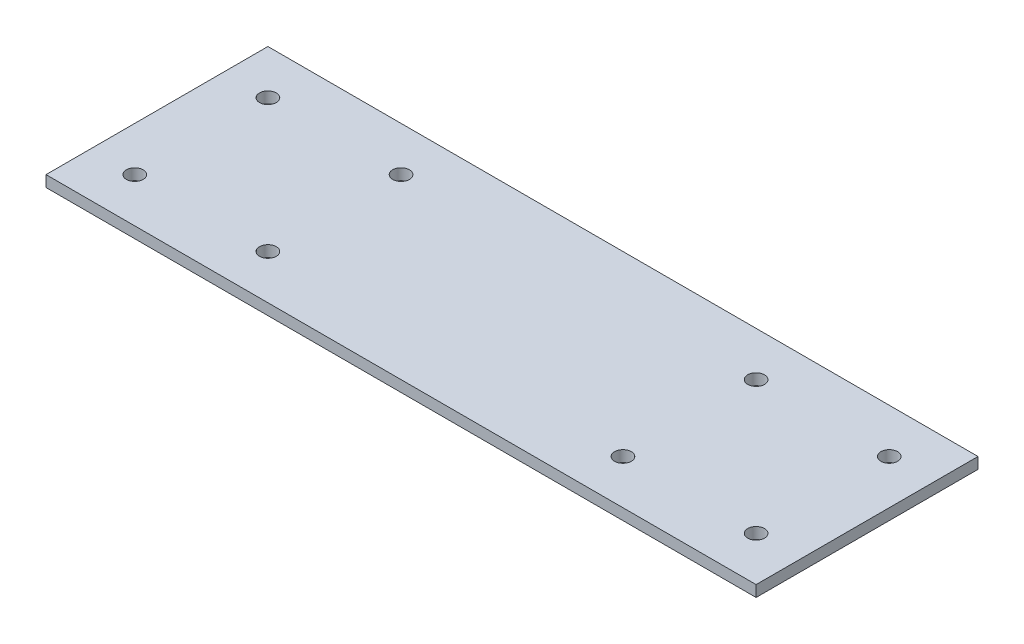
ISO-10303-21;
HEADER;
FILE_DESCRIPTION(('STEP AP214'),'2;1');
FILE_NAME('part.step','',(''),(''),'','','');
FILE_SCHEMA(('AUTOMOTIVE_DESIGN { 1 0 10303 214 1 1 1 1 }'));
ENDSEC;
DATA;
#1=APPLICATION_CONTEXT('core data for automotive mechanical design processes');
#2=APPLICATION_PROTOCOL_DEFINITION('international standard','automotive_design',2000,#1);
#3=PRODUCT_CONTEXT('',#1,'mechanical');
#4=PRODUCT('Part','Part','',(#3));
#5=PRODUCT_RELATED_PRODUCT_CATEGORY('part','',(#4));
#6=PRODUCT_DEFINITION_FORMATION('','',#4);
#7=PRODUCT_DEFINITION_CONTEXT('part definition',#1,'design');
#8=PRODUCT_DEFINITION('design','',#6,#7);
#9=PRODUCT_DEFINITION_SHAPE('','',#8);
#10=(LENGTH_UNIT() NAMED_UNIT(*) SI_UNIT(.MILLI.,.METRE.));
#11=(NAMED_UNIT(*) PLANE_ANGLE_UNIT() SI_UNIT($,.RADIAN.));
#12=(NAMED_UNIT(*) SI_UNIT($,.STERADIAN.) SOLID_ANGLE_UNIT());
#13=UNCERTAINTY_MEASURE_WITH_UNIT(LENGTH_MEASURE(1.E-05),#10,'distance_accuracy_value','');
#14=(GEOMETRIC_REPRESENTATION_CONTEXT(3) GLOBAL_UNCERTAINTY_ASSIGNED_CONTEXT((#13)) GLOBAL_UNIT_ASSIGNED_CONTEXT((#10,
#11,#12)) REPRESENTATION_CONTEXT('',''));
#15=CARTESIAN_POINT('',(0.,0.,0.));
#16=DIRECTION('',(0.,0.,1.));
#17=DIRECTION('',(1.,0.,0.));
#18=AXIS2_PLACEMENT_3D('',#15,#16,#17);
#19=CARTESIAN_POINT('',(50.8,1.6002,15.875));
#20=DIRECTION('',(-1.,0.,0.));
#21=DIRECTION('',(0.,0.,1.));
#22=AXIS2_PLACEMENT_3D('',#19,#20,#21);
#23=PLANE('',#22);
#24=DIRECTION('',(0.,0.,-1.));
#25=VECTOR('',#24,1.);
#26=CARTESIAN_POINT('',(50.8,0.,15.875));
#27=LINE('',#26,#25);
#28=CARTESIAN_POINT('',(50.8,0.,15.875));
#29=VERTEX_POINT('',#28);
#30=CARTESIAN_POINT('',(50.8,0.,-15.875));
#31=VERTEX_POINT('',#30);
#32=EDGE_CURVE('E107',#29,#31,#27,.T.);
#33=ORIENTED_EDGE('',*,*,#32,.T.);
#34=DIRECTION('',(0.,-1.,0.));
#35=VECTOR('',#34,1.);
#36=CARTESIAN_POINT('',(50.8,1.6002,-15.875));
#37=LINE('',#36,#35);
#38=CARTESIAN_POINT('',(50.8,1.6002,-15.875));
#39=VERTEX_POINT('',#38);
#40=EDGE_CURVE('E11',#39,#31,#37,.T.);
#41=ORIENTED_EDGE('',*,*,#40,.F.);
#42=DIRECTION('',(0.,0.,-1.));
#43=VECTOR('',#42,1.);
#44=CARTESIAN_POINT('',(50.8,1.6002,15.875));
#45=LINE('',#44,#43);
#46=CARTESIAN_POINT('',(50.8,1.6002,15.875));
#47=VERTEX_POINT('',#46);
#48=EDGE_CURVE('E91',#47,#39,#45,.T.);
#49=ORIENTED_EDGE('',*,*,#48,.F.);
#50=DIRECTION('',(0.,-1.,0.));
#51=VECTOR('',#50,1.);
#52=CARTESIAN_POINT('',(50.8,1.6002,15.875));
#53=LINE('',#52,#51);
#54=EDGE_CURVE('E103',#47,#29,#53,.T.);
#55=ORIENTED_EDGE('',*,*,#54,.T.);
#56=EDGE_LOOP('',(#33,#41,#49,#55));
#57=FACE_BOUND('',#56,.T.);
#58=ADVANCED_FACE('F39',(#57),#23,.F.);
#59=CARTESIAN_POINT('',(-50.8,1.6002,-15.875));
#60=DIRECTION('',(0.,0.,1.));
#61=DIRECTION('',(1.,0.,0.));
#62=AXIS2_PLACEMENT_3D('',#59,#60,#61);
#63=PLANE('',#62);
#64=DIRECTION('',(-1.,0.,0.));
#65=VECTOR('',#64,1.);
#66=CARTESIAN_POINT('',(-50.8,0.,-15.875));
#67=LINE('',#66,#65);
#68=CARTESIAN_POINT('',(-50.8,0.,-15.875));
#69=VERTEX_POINT('',#68);
#70=EDGE_CURVE('E96',#31,#69,#67,.T.);
#71=ORIENTED_EDGE('',*,*,#70,.T.);
#72=DIRECTION('',(0.,-1.,0.));
#73=VECTOR('',#72,1.);
#74=CARTESIAN_POINT('',(-50.8,1.6002,-15.875));
#75=LINE('',#74,#73);
#76=CARTESIAN_POINT('',(-50.8,1.6002,-15.875));
#77=VERTEX_POINT('',#76);
#78=EDGE_CURVE('E48',#77,#69,#75,.T.);
#79=ORIENTED_EDGE('',*,*,#78,.F.);
#80=DIRECTION('',(-1.,0.,0.));
#81=VECTOR('',#80,1.);
#82=CARTESIAN_POINT('',(-50.8,1.6002,-15.875));
#83=LINE('',#82,#81);
#84=EDGE_CURVE('E86',#39,#77,#83,.T.);
#85=ORIENTED_EDGE('',*,*,#84,.F.);
#86=ORIENTED_EDGE('',*,*,#40,.T.);
#87=EDGE_LOOP('',(#71,#79,#85,#86));
#88=FACE_BOUND('',#87,.T.);
#89=ADVANCED_FACE('F95',(#88),#63,.F.);
#90=CARTESIAN_POINT('',(-50.8,1.6002,15.875));
#91=DIRECTION('',(1.,0.,0.));
#92=DIRECTION('',(0.,0.,-1.));
#93=AXIS2_PLACEMENT_3D('',#90,#91,#92);
#94=PLANE('',#93);
#95=DIRECTION('',(0.,0.,1.));
#96=VECTOR('',#95,1.);
#97=CARTESIAN_POINT('',(-50.8,0.,15.875));
#98=LINE('',#97,#96);
#99=CARTESIAN_POINT('',(-50.8,0.,15.875));
#100=VERTEX_POINT('',#99);
#101=EDGE_CURVE('E73',#69,#100,#98,.T.);
#102=ORIENTED_EDGE('',*,*,#101,.T.);
#103=DIRECTION('',(0.,-1.,0.));
#104=VECTOR('',#103,1.);
#105=CARTESIAN_POINT('',(-50.8,1.6002,15.875));
#106=LINE('',#105,#104);
#107=CARTESIAN_POINT('',(-50.8,1.6002,15.875));
#108=VERTEX_POINT('',#107);
#109=EDGE_CURVE('E98',#108,#100,#106,.T.);
#110=ORIENTED_EDGE('',*,*,#109,.F.);
#111=DIRECTION('',(0.,0.,1.));
#112=VECTOR('',#111,1.);
#113=CARTESIAN_POINT('',(-50.8,1.6002,15.875));
#114=LINE('',#113,#112);
#115=EDGE_CURVE('E89',#77,#108,#114,.T.);
#116=ORIENTED_EDGE('',*,*,#115,.F.);
#117=ORIENTED_EDGE('',*,*,#78,.T.);
#118=EDGE_LOOP('',(#102,#110,#116,#117));
#119=FACE_BOUND('',#118,.T.);
#120=ADVANCED_FACE('F99',(#119),#94,.F.);
#121=CARTESIAN_POINT('',(-50.8,1.6002,15.875));
#122=DIRECTION('',(0.,0.,-1.));
#123=DIRECTION('',(-1.,0.,0.));
#124=AXIS2_PLACEMENT_3D('',#121,#122,#123);
#125=PLANE('',#124);
#126=DIRECTION('',(1.,0.,0.));
#127=VECTOR('',#126,1.);
#128=CARTESIAN_POINT('',(-50.8,0.,15.875));
#129=LINE('',#128,#127);
#130=EDGE_CURVE('E79',#100,#29,#129,.T.);
#131=ORIENTED_EDGE('',*,*,#130,.T.);
#132=ORIENTED_EDGE('',*,*,#54,.F.);
#133=DIRECTION('',(1.,0.,0.));
#134=VECTOR('',#133,1.);
#135=CARTESIAN_POINT('',(-50.8,1.6002,15.875));
#136=LINE('',#135,#134);
#137=EDGE_CURVE('E56',#108,#47,#136,.T.);
#138=ORIENTED_EDGE('',*,*,#137,.F.);
#139=ORIENTED_EDGE('',*,*,#109,.T.);
#140=EDGE_LOOP('',(#131,#132,#138,#139));
#141=FACE_BOUND('',#140,.T.);
#142=ADVANCED_FACE('F121',(#141),#125,.F.);
#143=CARTESIAN_POINT('',(0.,1.6002,0.));
#144=DIRECTION('',(0.,-1.,0.));
#145=DIRECTION('',(0.,0.,-1.));
#146=AXIS2_PLACEMENT_3D('',#143,#144,#145);
#147=PLANE('',#146);
#148=CARTESIAN_POINT('',(25.4,1.6002,-9.525));
#149=DIRECTION('',(0.,1.,0.));
#150=DIRECTION('',(0.,0.,1.));
#151=AXIS2_PLACEMENT_3D('',#148,#149,#150);
#152=CIRCLE('',#151,1.2);
#153=CARTESIAN_POINT('',(25.4,1.6002,-8.325));
#154=VERTEX_POINT('',#153);
#155=EDGE_CURVE('E187',#154,#154,#152,.T.);
#156=ORIENTED_EDGE('',*,*,#155,.F.);
#157=EDGE_LOOP('',(#156));
#158=FACE_BOUND('',#157,.T.);
#159=CARTESIAN_POINT('',(44.45,1.6002,-9.525));
#160=DIRECTION('',(0.,1.,0.));
#161=DIRECTION('',(0.,0.,1.));
#162=AXIS2_PLACEMENT_3D('',#159,#160,#161);
#163=CIRCLE('',#162,1.2);
#164=CARTESIAN_POINT('',(44.45,1.6002,-8.325));
#165=VERTEX_POINT('',#164);
#166=EDGE_CURVE('E179',#165,#165,#163,.T.);
#167=ORIENTED_EDGE('',*,*,#166,.F.);
#168=EDGE_LOOP('',(#167));
#169=FACE_BOUND('',#168,.T.);
#170=CARTESIAN_POINT('',(44.45,1.6002,9.525));
#171=DIRECTION('',(0.,1.,0.));
#172=DIRECTION('',(0.,0.,1.));
#173=AXIS2_PLACEMENT_3D('',#170,#171,#172);
#174=CIRCLE('',#173,1.2);
#175=CARTESIAN_POINT('',(44.45,1.6002,10.725));
#176=VERTEX_POINT('',#175);
#177=EDGE_CURVE('E171',#176,#176,#174,.T.);
#178=ORIENTED_EDGE('',*,*,#177,.F.);
#179=EDGE_LOOP('',(#178));
#180=FACE_BOUND('',#179,.T.);
#181=CARTESIAN_POINT('',(25.4,1.6002,9.525));
#182=DIRECTION('',(0.,1.,0.));
#183=DIRECTION('',(0.,0.,1.));
#184=AXIS2_PLACEMENT_3D('',#181,#182,#183);
#185=CIRCLE('',#184,1.2);
#186=CARTESIAN_POINT('',(25.4,1.6002,10.725));
#187=VERTEX_POINT('',#186);
#188=EDGE_CURVE('E163',#187,#187,#185,.T.);
#189=ORIENTED_EDGE('',*,*,#188,.F.);
#190=EDGE_LOOP('',(#189));
#191=FACE_BOUND('',#190,.T.);
#192=CARTESIAN_POINT('',(-25.4,1.6002,-9.525));
#193=DIRECTION('',(0.,1.,0.));
#194=DIRECTION('',(0.,0.,1.));
#195=AXIS2_PLACEMENT_3D('',#192,#193,#194);
#196=CIRCLE('',#195,1.2);
#197=CARTESIAN_POINT('',(-25.4,1.6002,-8.325));
#198=VERTEX_POINT('',#197);
#199=EDGE_CURVE('E155',#198,#198,#196,.T.);
#200=ORIENTED_EDGE('',*,*,#199,.F.);
#201=EDGE_LOOP('',(#200));
#202=FACE_BOUND('',#201,.T.);
#203=CARTESIAN_POINT('',(-44.45,1.6002,-9.525));
#204=DIRECTION('',(0.,1.,0.));
#205=DIRECTION('',(0.,0.,1.));
#206=AXIS2_PLACEMENT_3D('',#203,#204,#205);
#207=CIRCLE('',#206,1.2);
#208=CARTESIAN_POINT('',(-44.45,1.6002,-8.325));
#209=VERTEX_POINT('',#208);
#210=EDGE_CURVE('E147',#209,#209,#207,.T.);
#211=ORIENTED_EDGE('',*,*,#210,.F.);
#212=EDGE_LOOP('',(#211));
#213=FACE_BOUND('',#212,.T.);
#214=CARTESIAN_POINT('',(-44.45,1.6002,9.525));
#215=DIRECTION('',(0.,1.,0.));
#216=DIRECTION('',(0.,0.,1.));
#217=AXIS2_PLACEMENT_3D('',#214,#215,#216);
#218=CIRCLE('',#217,1.2);
#219=CARTESIAN_POINT('',(-44.45,1.6002,10.725));
#220=VERTEX_POINT('',#219);
#221=EDGE_CURVE('E139',#220,#220,#218,.T.);
#222=ORIENTED_EDGE('',*,*,#221,.F.);
#223=EDGE_LOOP('',(#222));
#224=FACE_BOUND('',#223,.T.);
#225=CARTESIAN_POINT('',(-25.4,1.6002,9.525));
#226=DIRECTION('',(0.,1.,0.));
#227=DIRECTION('',(0.,0.,1.));
#228=AXIS2_PLACEMENT_3D('',#225,#226,#227);
#229=CIRCLE('',#228,1.2);
#230=CARTESIAN_POINT('',(-25.4,1.6002,10.725));
#231=VERTEX_POINT('',#230);
#232=EDGE_CURVE('E131',#231,#231,#229,.T.);
#233=ORIENTED_EDGE('',*,*,#232,.F.);
#234=EDGE_LOOP('',(#233));
#235=FACE_BOUND('',#234,.T.);
#236=ORIENTED_EDGE('',*,*,#48,.T.);
#237=ORIENTED_EDGE('',*,*,#84,.T.);
#238=ORIENTED_EDGE('',*,*,#115,.T.);
#239=ORIENTED_EDGE('',*,*,#137,.T.);
#240=EDGE_LOOP('',(#236,#237,#238,#239));
#241=FACE_BOUND('',#240,.T.);
#242=ADVANCED_FACE('F87',(#158,#169,#180,#191,#202,#213,#224,#235,#241),#147,.F.);
#243=CARTESIAN_POINT('',(0.,0.,0.));
#244=DIRECTION('',(0.,-1.,0.));
#245=DIRECTION('',(0.,0.,-1.));
#246=AXIS2_PLACEMENT_3D('',#243,#244,#245);
#247=PLANE('',#246);
#248=CARTESIAN_POINT('',(25.4,0.,-9.525));
#249=DIRECTION('',(0.,1.,0.));
#250=DIRECTION('',(0.,0.,1.));
#251=AXIS2_PLACEMENT_3D('',#248,#249,#250);
#252=CIRCLE('',#251,1.2);
#253=CARTESIAN_POINT('',(25.4,0.,-8.325));
#254=VERTEX_POINT('',#253);
#255=EDGE_CURVE('E183',#254,#254,#252,.T.);
#256=ORIENTED_EDGE('',*,*,#255,.T.);
#257=EDGE_LOOP('',(#256));
#258=FACE_BOUND('',#257,.T.);
#259=CARTESIAN_POINT('',(44.45,0.,-9.525));
#260=DIRECTION('',(0.,1.,0.));
#261=DIRECTION('',(0.,0.,1.));
#262=AXIS2_PLACEMENT_3D('',#259,#260,#261);
#263=CIRCLE('',#262,1.2);
#264=CARTESIAN_POINT('',(44.45,0.,-8.325));
#265=VERTEX_POINT('',#264);
#266=EDGE_CURVE('E175',#265,#265,#263,.T.);
#267=ORIENTED_EDGE('',*,*,#266,.T.);
#268=EDGE_LOOP('',(#267));
#269=FACE_BOUND('',#268,.T.);
#270=CARTESIAN_POINT('',(44.45,0.,9.525));
#271=DIRECTION('',(0.,1.,0.));
#272=DIRECTION('',(0.,0.,1.));
#273=AXIS2_PLACEMENT_3D('',#270,#271,#272);
#274=CIRCLE('',#273,1.2);
#275=CARTESIAN_POINT('',(44.45,0.,10.725));
#276=VERTEX_POINT('',#275);
#277=EDGE_CURVE('E167',#276,#276,#274,.T.);
#278=ORIENTED_EDGE('',*,*,#277,.T.);
#279=EDGE_LOOP('',(#278));
#280=FACE_BOUND('',#279,.T.);
#281=CARTESIAN_POINT('',(25.4,0.,9.525));
#282=DIRECTION('',(0.,1.,0.));
#283=DIRECTION('',(0.,0.,1.));
#284=AXIS2_PLACEMENT_3D('',#281,#282,#283);
#285=CIRCLE('',#284,1.2);
#286=CARTESIAN_POINT('',(25.4,0.,10.725));
#287=VERTEX_POINT('',#286);
#288=EDGE_CURVE('E159',#287,#287,#285,.T.);
#289=ORIENTED_EDGE('',*,*,#288,.T.);
#290=EDGE_LOOP('',(#289));
#291=FACE_BOUND('',#290,.T.);
#292=CARTESIAN_POINT('',(-25.4,0.,-9.525));
#293=DIRECTION('',(0.,1.,0.));
#294=DIRECTION('',(0.,0.,1.));
#295=AXIS2_PLACEMENT_3D('',#292,#293,#294);
#296=CIRCLE('',#295,1.2);
#297=CARTESIAN_POINT('',(-25.4,0.,-8.325));
#298=VERTEX_POINT('',#297);
#299=EDGE_CURVE('E151',#298,#298,#296,.T.);
#300=ORIENTED_EDGE('',*,*,#299,.T.);
#301=EDGE_LOOP('',(#300));
#302=FACE_BOUND('',#301,.T.);
#303=CARTESIAN_POINT('',(-44.45,0.,-9.525));
#304=DIRECTION('',(0.,1.,0.));
#305=DIRECTION('',(0.,0.,1.));
#306=AXIS2_PLACEMENT_3D('',#303,#304,#305);
#307=CIRCLE('',#306,1.2);
#308=CARTESIAN_POINT('',(-44.45,0.,-8.325));
#309=VERTEX_POINT('',#308);
#310=EDGE_CURVE('E143',#309,#309,#307,.T.);
#311=ORIENTED_EDGE('',*,*,#310,.T.);
#312=EDGE_LOOP('',(#311));
#313=FACE_BOUND('',#312,.T.);
#314=CARTESIAN_POINT('',(-44.45,0.,9.525));
#315=DIRECTION('',(0.,1.,0.));
#316=DIRECTION('',(0.,0.,1.));
#317=AXIS2_PLACEMENT_3D('',#314,#315,#316);
#318=CIRCLE('',#317,1.2);
#319=CARTESIAN_POINT('',(-44.45,0.,10.725));
#320=VERTEX_POINT('',#319);
#321=EDGE_CURVE('E135',#320,#320,#318,.T.);
#322=ORIENTED_EDGE('',*,*,#321,.T.);
#323=EDGE_LOOP('',(#322));
#324=FACE_BOUND('',#323,.T.);
#325=CARTESIAN_POINT('',(-25.4,0.,9.525));
#326=DIRECTION('',(0.,1.,0.));
#327=DIRECTION('',(0.,0.,1.));
#328=AXIS2_PLACEMENT_3D('',#325,#326,#327);
#329=CIRCLE('',#328,1.2);
#330=CARTESIAN_POINT('',(-25.4,0.,10.725));
#331=VERTEX_POINT('',#330);
#332=EDGE_CURVE('E111',#331,#331,#329,.T.);
#333=ORIENTED_EDGE('',*,*,#332,.T.);
#334=EDGE_LOOP('',(#333));
#335=FACE_BOUND('',#334,.T.);
#336=ORIENTED_EDGE('',*,*,#32,.F.);
#337=ORIENTED_EDGE('',*,*,#130,.F.);
#338=ORIENTED_EDGE('',*,*,#101,.F.);
#339=ORIENTED_EDGE('',*,*,#70,.F.);
#340=EDGE_LOOP('',(#336,#337,#338,#339));
#341=FACE_BOUND('',#340,.T.);
#342=ADVANCED_FACE('F124',(#258,#269,#280,#291,#302,#313,#324,#335,#341),#247,.T.);
#343=CARTESIAN_POINT('',(-25.4,1.6002,9.525));
#344=DIRECTION('',(0.,1.,0.));
#345=DIRECTION('',(0.,0.,1.));
#346=AXIS2_PLACEMENT_3D('',#343,#344,#345);
#347=CYLINDRICAL_SURFACE('',#346,1.2);
#348=ORIENTED_EDGE('',*,*,#332,.F.);
#349=EDGE_LOOP('',(#348));
#350=FACE_BOUND('',#349,.T.);
#351=ORIENTED_EDGE('',*,*,#232,.T.);
#352=EDGE_LOOP('',(#351));
#353=FACE_BOUND('',#352,.T.);
#354=ADVANCED_FACE('F211',(#350,#353),#347,.F.);
#355=CARTESIAN_POINT('',(-44.45,1.6002,9.525));
#356=DIRECTION('',(0.,1.,0.));
#357=DIRECTION('',(0.,0.,1.));
#358=AXIS2_PLACEMENT_3D('',#355,#356,#357);
#359=CYLINDRICAL_SURFACE('',#358,1.2);
#360=ORIENTED_EDGE('',*,*,#321,.F.);
#361=EDGE_LOOP('',(#360));
#362=FACE_BOUND('',#361,.T.);
#363=ORIENTED_EDGE('',*,*,#221,.T.);
#364=EDGE_LOOP('',(#363));
#365=FACE_BOUND('',#364,.T.);
#366=ADVANCED_FACE('F213',(#362,#365),#359,.F.);
#367=CARTESIAN_POINT('',(-44.45,1.6002,-9.525));
#368=DIRECTION('',(0.,1.,0.));
#369=DIRECTION('',(0.,0.,1.));
#370=AXIS2_PLACEMENT_3D('',#367,#368,#369);
#371=CYLINDRICAL_SURFACE('',#370,1.2);
#372=ORIENTED_EDGE('',*,*,#310,.F.);
#373=EDGE_LOOP('',(#372));
#374=FACE_BOUND('',#373,.T.);
#375=ORIENTED_EDGE('',*,*,#210,.T.);
#376=EDGE_LOOP('',(#375));
#377=FACE_BOUND('',#376,.T.);
#378=ADVANCED_FACE('F220',(#374,#377),#371,.F.);
#379=CARTESIAN_POINT('',(-25.4,1.6002,-9.525));
#380=DIRECTION('',(0.,1.,0.));
#381=DIRECTION('',(0.,0.,1.));
#382=AXIS2_PLACEMENT_3D('',#379,#380,#381);
#383=CYLINDRICAL_SURFACE('',#382,1.2);
#384=ORIENTED_EDGE('',*,*,#299,.F.);
#385=EDGE_LOOP('',(#384));
#386=FACE_BOUND('',#385,.T.);
#387=ORIENTED_EDGE('',*,*,#199,.T.);
#388=EDGE_LOOP('',(#387));
#389=FACE_BOUND('',#388,.T.);
#390=ADVANCED_FACE('F261',(#386,#389),#383,.F.);
#391=CARTESIAN_POINT('',(25.4,1.6002,9.525));
#392=DIRECTION('',(0.,1.,0.));
#393=DIRECTION('',(0.,0.,1.));
#394=AXIS2_PLACEMENT_3D('',#391,#392,#393);
#395=CYLINDRICAL_SURFACE('',#394,1.2);
#396=ORIENTED_EDGE('',*,*,#288,.F.);
#397=EDGE_LOOP('',(#396));
#398=FACE_BOUND('',#397,.T.);
#399=ORIENTED_EDGE('',*,*,#188,.T.);
#400=EDGE_LOOP('',(#399));
#401=FACE_BOUND('',#400,.T.);
#402=ADVANCED_FACE('F255',(#398,#401),#395,.F.);
#403=CARTESIAN_POINT('',(44.45,1.6002,9.525));
#404=DIRECTION('',(0.,1.,0.));
#405=DIRECTION('',(0.,0.,1.));
#406=AXIS2_PLACEMENT_3D('',#403,#404,#405);
#407=CYLINDRICAL_SURFACE('',#406,1.2);
#408=ORIENTED_EDGE('',*,*,#277,.F.);
#409=EDGE_LOOP('',(#408));
#410=FACE_BOUND('',#409,.T.);
#411=ORIENTED_EDGE('',*,*,#177,.T.);
#412=EDGE_LOOP('',(#411));
#413=FACE_BOUND('',#412,.T.);
#414=ADVANCED_FACE('F260',(#410,#413),#407,.F.);
#415=CARTESIAN_POINT('',(44.45,1.6002,-9.525));
#416=DIRECTION('',(0.,1.,0.));
#417=DIRECTION('',(0.,0.,1.));
#418=AXIS2_PLACEMENT_3D('',#415,#416,#417);
#419=CYLINDRICAL_SURFACE('',#418,1.2);
#420=ORIENTED_EDGE('',*,*,#266,.F.);
#421=EDGE_LOOP('',(#420));
#422=FACE_BOUND('',#421,.T.);
#423=ORIENTED_EDGE('',*,*,#166,.T.);
#424=EDGE_LOOP('',(#423));
#425=FACE_BOUND('',#424,.T.);
#426=ADVANCED_FACE('F273',(#422,#425),#419,.F.);
#427=CARTESIAN_POINT('',(25.4,1.6002,-9.525));
#428=DIRECTION('',(0.,1.,0.));
#429=DIRECTION('',(0.,0.,1.));
#430=AXIS2_PLACEMENT_3D('',#427,#428,#429);
#431=CYLINDRICAL_SURFACE('',#430,1.2);
#432=ORIENTED_EDGE('',*,*,#255,.F.);
#433=EDGE_LOOP('',(#432));
#434=FACE_BOUND('',#433,.T.);
#435=ORIENTED_EDGE('',*,*,#155,.T.);
#436=EDGE_LOOP('',(#435));
#437=FACE_BOUND('',#436,.T.);
#438=ADVANCED_FACE('F192',(#434,#437),#431,.F.);
#439=CLOSED_SHELL('',(#58,#89,#120,#142,#242,#342,#354,#366,#378,#390,#402,#414,#426,#438));
#440=MANIFOLD_SOLID_BREP('B2',#439);
#441=ADVANCED_BREP_SHAPE_REPRESENTATION('',(#18,#440),#14);
#442=SHAPE_DEFINITION_REPRESENTATION(#9,#441);
ENDSEC;
END-ISO-10303-21;
